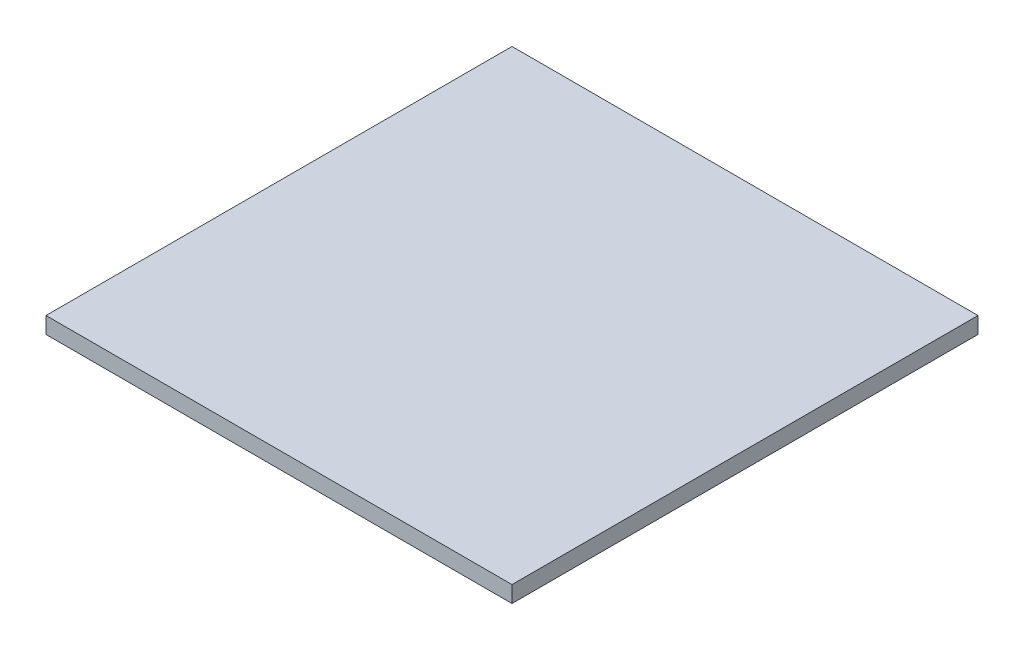
ISO-10303-21;
HEADER;
FILE_DESCRIPTION(('STEP AP214'),'2;1');
FILE_NAME('part.step','',(''),(''),'','','');
FILE_SCHEMA(('AUTOMOTIVE_DESIGN { 1 0 10303 214 1 1 1 1 }'));
ENDSEC;
DATA;
#1=APPLICATION_CONTEXT('core data for automotive mechanical design processes');
#2=APPLICATION_PROTOCOL_DEFINITION('international standard','automotive_design',2000,#1);
#3=PRODUCT_CONTEXT('',#1,'mechanical');
#4=PRODUCT('Part','Part','',(#3));
#5=PRODUCT_RELATED_PRODUCT_CATEGORY('part','',(#4));
#6=PRODUCT_DEFINITION_FORMATION('','',#4);
#7=PRODUCT_DEFINITION_CONTEXT('part definition',#1,'design');
#8=PRODUCT_DEFINITION('design','',#6,#7);
#9=PRODUCT_DEFINITION_SHAPE('','',#8);
#10=(LENGTH_UNIT() NAMED_UNIT(*) SI_UNIT(.MILLI.,.METRE.));
#11=(NAMED_UNIT(*) PLANE_ANGLE_UNIT() SI_UNIT($,.RADIAN.));
#12=(NAMED_UNIT(*) SI_UNIT($,.STERADIAN.) SOLID_ANGLE_UNIT());
#13=UNCERTAINTY_MEASURE_WITH_UNIT(LENGTH_MEASURE(1.E-05),#10,'distance_accuracy_value','');
#14=(GEOMETRIC_REPRESENTATION_CONTEXT(3) GLOBAL_UNCERTAINTY_ASSIGNED_CONTEXT((#13)) GLOBAL_UNIT_ASSIGNED_CONTEXT((#10,
#11,#12)) REPRESENTATION_CONTEXT('',''));
#15=CARTESIAN_POINT('',(0.,0.,0.));
#16=DIRECTION('',(0.,0.,1.));
#17=DIRECTION('',(1.,0.,0.));
#18=AXIS2_PLACEMENT_3D('',#15,#16,#17);
#19=CARTESIAN_POINT('',(42.5,3.,42.5));
#20=DIRECTION('',(-1.,0.,0.));
#21=DIRECTION('',(0.,0.,1.));
#22=AXIS2_PLACEMENT_3D('',#19,#20,#21);
#23=PLANE('',#22);
#24=DIRECTION('',(0.,0.,-1.));
#25=VECTOR('',#24,1.);
#26=CARTESIAN_POINT('',(42.5,0.,42.5));
#27=LINE('',#26,#25);
#28=CARTESIAN_POINT('',(42.5,0.,42.5));
#29=VERTEX_POINT('',#28);
#30=CARTESIAN_POINT('',(42.5,0.,-42.5));
#31=VERTEX_POINT('',#30);
#32=EDGE_CURVE('E96',#29,#31,#27,.T.);
#33=ORIENTED_EDGE('',*,*,#32,.T.);
#34=DIRECTION('',(0.,-1.,0.));
#35=VECTOR('',#34,1.);
#36=CARTESIAN_POINT('',(42.5,3.,-42.5));
#37=LINE('',#36,#35);
#38=CARTESIAN_POINT('',(42.5,3.,-42.5));
#39=VERTEX_POINT('',#38);
#40=EDGE_CURVE('E11',#39,#31,#37,.T.);
#41=ORIENTED_EDGE('',*,*,#40,.F.);
#42=DIRECTION('',(0.,0.,-1.));
#43=VECTOR('',#42,1.);
#44=CARTESIAN_POINT('',(42.5,3.,42.5));
#45=LINE('',#44,#43);
#46=CARTESIAN_POINT('',(42.5,3.,42.5));
#47=VERTEX_POINT('',#46);
#48=EDGE_CURVE('E84',#47,#39,#45,.T.);
#49=ORIENTED_EDGE('',*,*,#48,.F.);
#50=DIRECTION('',(0.,-1.,0.));
#51=VECTOR('',#50,1.);
#52=CARTESIAN_POINT('',(42.5,3.,42.5));
#53=LINE('',#52,#51);
#54=EDGE_CURVE('E92',#47,#29,#53,.T.);
#55=ORIENTED_EDGE('',*,*,#54,.T.);
#56=EDGE_LOOP('',(#33,#41,#49,#55));
#57=FACE_BOUND('',#56,.T.);
#58=ADVANCED_FACE('F33',(#57),#23,.F.);
#59=CARTESIAN_POINT('',(-42.5,3.,-42.5));
#60=DIRECTION('',(0.,0.,1.));
#61=DIRECTION('',(1.,0.,0.));
#62=AXIS2_PLACEMENT_3D('',#59,#60,#61);
#63=PLANE('',#62);
#64=DIRECTION('',(-1.,0.,0.));
#65=VECTOR('',#64,1.);
#66=CARTESIAN_POINT('',(-42.5,0.,-42.5));
#67=LINE('',#66,#65);
#68=CARTESIAN_POINT('',(-42.5,0.,-42.5));
#69=VERTEX_POINT('',#68);
#70=EDGE_CURVE('E88',#31,#69,#67,.T.);
#71=ORIENTED_EDGE('',*,*,#70,.T.);
#72=DIRECTION('',(0.,-1.,0.));
#73=VECTOR('',#72,1.);
#74=CARTESIAN_POINT('',(-42.5,3.,-42.5));
#75=LINE('',#74,#73);
#76=CARTESIAN_POINT('',(-42.5,3.,-42.5));
#77=VERTEX_POINT('',#76);
#78=EDGE_CURVE('E41',#77,#69,#75,.T.);
#79=ORIENTED_EDGE('',*,*,#78,.F.);
#80=DIRECTION('',(-1.,0.,0.));
#81=VECTOR('',#80,1.);
#82=CARTESIAN_POINT('',(-42.5,3.,-42.5));
#83=LINE('',#82,#81);
#84=EDGE_CURVE('E79',#39,#77,#83,.T.);
#85=ORIENTED_EDGE('',*,*,#84,.F.);
#86=ORIENTED_EDGE('',*,*,#40,.T.);
#87=EDGE_LOOP('',(#71,#79,#85,#86));
#88=FACE_BOUND('',#87,.T.);
#89=ADVANCED_FACE('F87',(#88),#63,.F.);
#90=CARTESIAN_POINT('',(-42.5,3.,42.5));
#91=DIRECTION('',(1.,0.,0.));
#92=DIRECTION('',(0.,0.,-1.));
#93=AXIS2_PLACEMENT_3D('',#90,#91,#92);
#94=PLANE('',#93);
#95=DIRECTION('',(0.,0.,1.));
#96=VECTOR('',#95,1.);
#97=CARTESIAN_POINT('',(-42.5,0.,42.5));
#98=LINE('',#97,#96);
#99=CARTESIAN_POINT('',(-42.5,0.,42.5));
#100=VERTEX_POINT('',#99);
#101=EDGE_CURVE('E66',#69,#100,#98,.T.);
#102=ORIENTED_EDGE('',*,*,#101,.T.);
#103=DIRECTION('',(0.,-1.,0.));
#104=VECTOR('',#103,1.);
#105=CARTESIAN_POINT('',(-42.5,3.,42.5));
#106=LINE('',#105,#104);
#107=CARTESIAN_POINT('',(-42.5,3.,42.5));
#108=VERTEX_POINT('',#107);
#109=EDGE_CURVE('E89',#108,#100,#106,.T.);
#110=ORIENTED_EDGE('',*,*,#109,.F.);
#111=DIRECTION('',(0.,0.,1.));
#112=VECTOR('',#111,1.);
#113=CARTESIAN_POINT('',(-42.5,3.,42.5));
#114=LINE('',#113,#112);
#115=EDGE_CURVE('E82',#77,#108,#114,.T.);
#116=ORIENTED_EDGE('',*,*,#115,.F.);
#117=ORIENTED_EDGE('',*,*,#78,.T.);
#118=EDGE_LOOP('',(#102,#110,#116,#117));
#119=FACE_BOUND('',#118,.T.);
#120=ADVANCED_FACE('F90',(#119),#94,.F.);
#121=CARTESIAN_POINT('',(-42.5,3.,42.5));
#122=DIRECTION('',(0.,0.,-1.));
#123=DIRECTION('',(-1.,0.,0.));
#124=AXIS2_PLACEMENT_3D('',#121,#122,#123);
#125=PLANE('',#124);
#126=DIRECTION('',(1.,0.,0.));
#127=VECTOR('',#126,1.);
#128=CARTESIAN_POINT('',(-42.5,0.,42.5));
#129=LINE('',#128,#127);
#130=EDGE_CURVE('E72',#100,#29,#129,.T.);
#131=ORIENTED_EDGE('',*,*,#130,.T.);
#132=ORIENTED_EDGE('',*,*,#54,.F.);
#133=DIRECTION('',(1.,0.,0.));
#134=VECTOR('',#133,1.);
#135=CARTESIAN_POINT('',(-42.5,3.,42.5));
#136=LINE('',#135,#134);
#137=EDGE_CURVE('E49',#108,#47,#136,.T.);
#138=ORIENTED_EDGE('',*,*,#137,.F.);
#139=ORIENTED_EDGE('',*,*,#109,.T.);
#140=EDGE_LOOP('',(#131,#132,#138,#139));
#141=FACE_BOUND('',#140,.T.);
#142=ADVANCED_FACE('F103',(#141),#125,.F.);
#143=CARTESIAN_POINT('',(0.,3.,0.));
#144=DIRECTION('',(0.,-1.,0.));
#145=DIRECTION('',(0.,0.,-1.));
#146=AXIS2_PLACEMENT_3D('',#143,#144,#145);
#147=PLANE('',#146);
#148=ORIENTED_EDGE('',*,*,#48,.T.);
#149=ORIENTED_EDGE('',*,*,#84,.T.);
#150=ORIENTED_EDGE('',*,*,#115,.T.);
#151=ORIENTED_EDGE('',*,*,#137,.T.);
#152=EDGE_LOOP('',(#148,#149,#150,#151));
#153=FACE_BOUND('',#152,.T.);
#154=ADVANCED_FACE('F80',(#153),#147,.F.);
#155=CARTESIAN_POINT('',(0.,0.,0.));
#156=DIRECTION('',(0.,-1.,0.));
#157=DIRECTION('',(0.,0.,-1.));
#158=AXIS2_PLACEMENT_3D('',#155,#156,#157);
#159=PLANE('',#158);
#160=ORIENTED_EDGE('',*,*,#32,.F.);
#161=ORIENTED_EDGE('',*,*,#130,.F.);
#162=ORIENTED_EDGE('',*,*,#101,.F.);
#163=ORIENTED_EDGE('',*,*,#70,.F.);
#164=EDGE_LOOP('',(#160,#161,#162,#163));
#165=FACE_BOUND('',#164,.T.);
#166=ADVANCED_FACE('F106',(#165),#159,.T.);
#167=CLOSED_SHELL('',(#58,#89,#120,#142,#154,#166));
#168=MANIFOLD_SOLID_BREP('B2',#167);
#169=ADVANCED_BREP_SHAPE_REPRESENTATION('',(#18,#168),#14);
#170=SHAPE_DEFINITION_REPRESENTATION(#9,#169);
ENDSEC;
END-ISO-10303-21;
